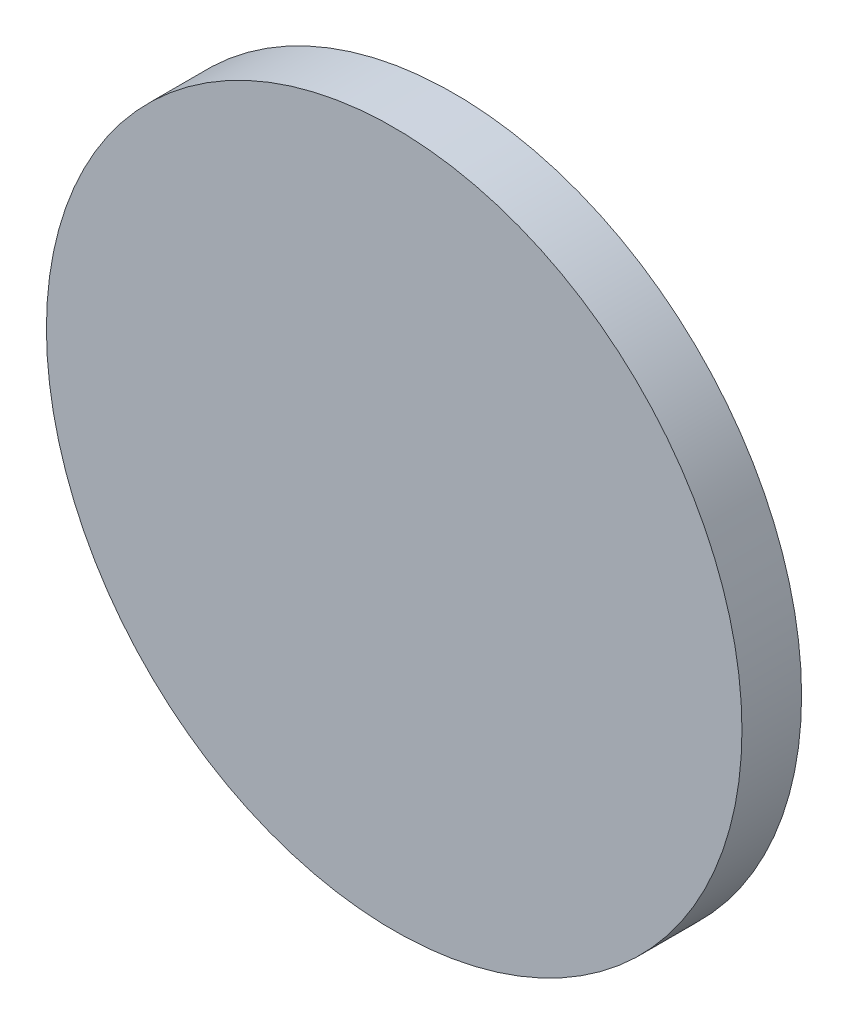
ISO-10303-21;
HEADER;
FILE_DESCRIPTION(('STEP AP214'),'2;1');
FILE_NAME('part.step','',(''),(''),'','','');
FILE_SCHEMA(('AUTOMOTIVE_DESIGN { 1 0 10303 214 1 1 1 1 }'));
ENDSEC;
DATA;
#1=APPLICATION_CONTEXT('core data for automotive mechanical design processes');
#2=APPLICATION_PROTOCOL_DEFINITION('international standard','automotive_design',2000,#1);
#3=PRODUCT_CONTEXT('',#1,'mechanical');
#4=PRODUCT('Part','Part','',(#3));
#5=PRODUCT_RELATED_PRODUCT_CATEGORY('part','',(#4));
#6=PRODUCT_DEFINITION_FORMATION('','',#4);
#7=PRODUCT_DEFINITION_CONTEXT('part definition',#1,'design');
#8=PRODUCT_DEFINITION('design','',#6,#7);
#9=PRODUCT_DEFINITION_SHAPE('','',#8);
#10=(LENGTH_UNIT() NAMED_UNIT(*) SI_UNIT(.MILLI.,.METRE.));
#11=(NAMED_UNIT(*) PLANE_ANGLE_UNIT() SI_UNIT($,.RADIAN.));
#12=(NAMED_UNIT(*) SI_UNIT($,.STERADIAN.) SOLID_ANGLE_UNIT());
#13=UNCERTAINTY_MEASURE_WITH_UNIT(LENGTH_MEASURE(1.E-05),#10,'distance_accuracy_value','');
#14=(GEOMETRIC_REPRESENTATION_CONTEXT(3) GLOBAL_UNCERTAINTY_ASSIGNED_CONTEXT((#13)) GLOBAL_UNIT_ASSIGNED_CONTEXT((#10,
#11,#12)) REPRESENTATION_CONTEXT('',''));
#15=CARTESIAN_POINT('',(0.,0.,0.));
#16=DIRECTION('',(0.,0.,1.));
#17=DIRECTION('',(1.,0.,0.));
#18=AXIS2_PLACEMENT_3D('',#15,#16,#17);
#19=CARTESIAN_POINT('',(11.409,6.178000014875,0.));
#20=DIRECTION('',(0.,0.,-1.));
#21=DIRECTION('',(-1.,0.,0.));
#22=AXIS2_PLACEMENT_3D('',#19,#20,#21);
#23=PLANE('',#22);
#24=CARTESIAN_POINT('',(11.409,6.178000014875,0.));
#25=DIRECTION('',(0.,0.,1.));
#26=DIRECTION('',(1.,0.,0.));
#27=AXIS2_PLACEMENT_3D('',#24,#25,#26);
#28=CIRCLE('',#27,0.200024667);
#29=CARTESIAN_POINT('',(11.609024667,6.178000014875,0.));
#30=VERTEX_POINT('',#29);
#31=EDGE_CURVE('E18',#30,#30,#28,.T.);
#32=ORIENTED_EDGE('',*,*,#31,.F.);
#33=EDGE_LOOP('',(#32));
#34=FACE_BOUND('',#33,.T.);
#35=ADVANCED_FACE('F15',(#34),#23,.T.);
#36=CARTESIAN_POINT('',(11.409,6.178000014875,0.));
#37=DIRECTION('',(0.,0.,1.));
#38=DIRECTION('',(1.,0.,0.));
#39=AXIS2_PLACEMENT_3D('',#36,#37,#38);
#40=CYLINDRICAL_SURFACE('',#39,0.200024667);
#41=CARTESIAN_POINT('',(11.409,6.178000014875,0.03429));
#42=DIRECTION('',(0.,0.,1.));
#43=DIRECTION('',(1.,0.,0.));
#44=AXIS2_PLACEMENT_3D('',#41,#42,#43);
#45=CIRCLE('',#44,0.200024667);
#46=CARTESIAN_POINT('',(11.609024667,6.178000014875,0.03429));
#47=VERTEX_POINT('',#46);
#48=EDGE_CURVE('E10',#47,#47,#45,.T.);
#49=ORIENTED_EDGE('',*,*,#48,.F.);
#50=EDGE_LOOP('',(#49));
#51=FACE_BOUND('',#50,.T.);
#52=ORIENTED_EDGE('',*,*,#31,.T.);
#53=EDGE_LOOP('',(#52));
#54=FACE_BOUND('',#53,.T.);
#55=ADVANCED_FACE('F27',(#51,#54),#40,.T.);
#56=CARTESIAN_POINT('',(11.409,6.178000014875,0.03429));
#57=DIRECTION('',(0.,0.,1.));
#58=DIRECTION('',(1.,0.,0.));
#59=AXIS2_PLACEMENT_3D('',#56,#57,#58);
#60=PLANE('',#59);
#61=ORIENTED_EDGE('',*,*,#48,.T.);
#62=EDGE_LOOP('',(#61));
#63=FACE_BOUND('',#62,.T.);
#64=ADVANCED_FACE('F34',(#63),#60,.T.);
#65=CLOSED_SHELL('',(#35,#55,#64));
#66=MANIFOLD_SOLID_BREP('B1',#65);
#67=ADVANCED_BREP_SHAPE_REPRESENTATION('',(#18,#66),#14);
#68=SHAPE_DEFINITION_REPRESENTATION(#9,#67);
ENDSEC;
END-ISO-10303-21;
